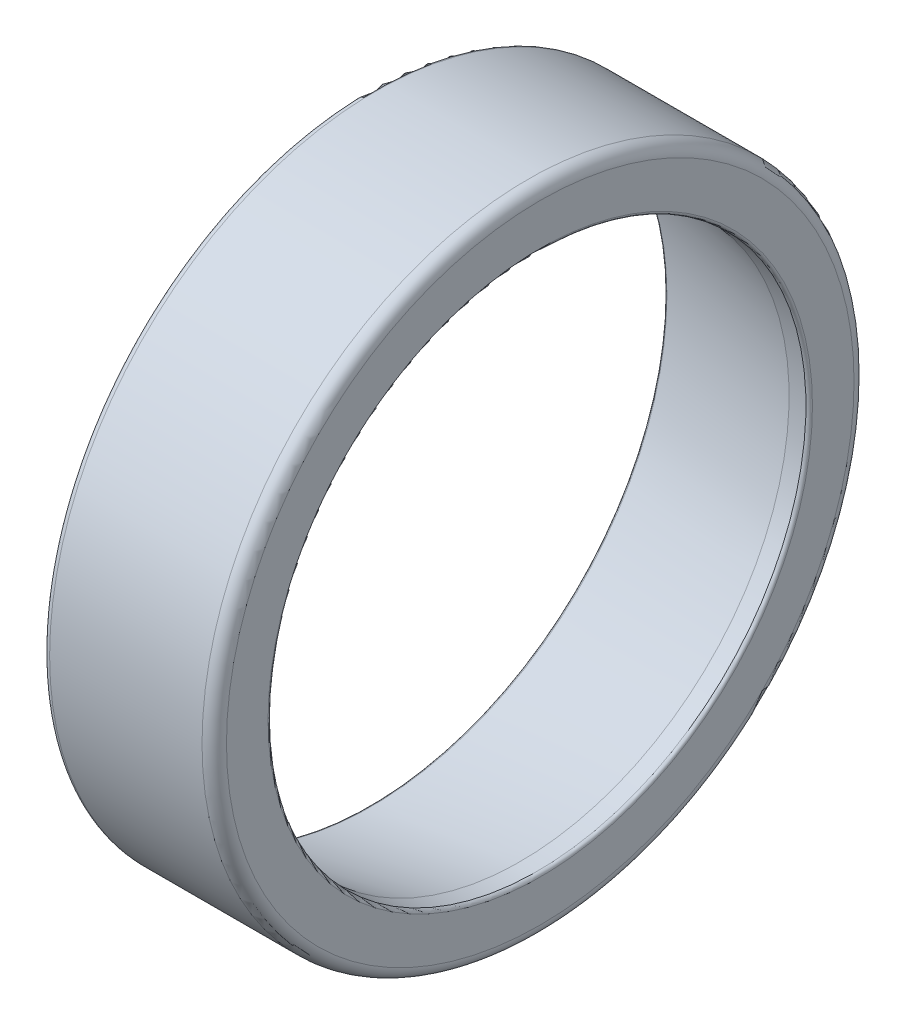
ISO-10303-21;
HEADER;
FILE_DESCRIPTION(('STEP AP214'),'2;1');
FILE_NAME('part.step','',(''),(''),'','','');
FILE_SCHEMA(('AUTOMOTIVE_DESIGN { 1 0 10303 214 1 1 1 1 }'));
ENDSEC;
DATA;
#1=APPLICATION_CONTEXT('core data for automotive mechanical design processes');
#2=APPLICATION_PROTOCOL_DEFINITION('international standard','automotive_design',2000,#1);
#3=PRODUCT_CONTEXT('',#1,'mechanical');
#4=PRODUCT('Part','Part','',(#3));
#5=PRODUCT_RELATED_PRODUCT_CATEGORY('part','',(#4));
#6=PRODUCT_DEFINITION_FORMATION('','',#4);
#7=PRODUCT_DEFINITION_CONTEXT('part definition',#1,'design');
#8=PRODUCT_DEFINITION('design','',#6,#7);
#9=PRODUCT_DEFINITION_SHAPE('','',#8);
#10=(LENGTH_UNIT() NAMED_UNIT(*) SI_UNIT(.MILLI.,.METRE.));
#11=(NAMED_UNIT(*) PLANE_ANGLE_UNIT() SI_UNIT($,.RADIAN.));
#12=(NAMED_UNIT(*) SI_UNIT($,.STERADIAN.) SOLID_ANGLE_UNIT());
#13=UNCERTAINTY_MEASURE_WITH_UNIT(LENGTH_MEASURE(1.E-05),#10,'distance_accuracy_value','');
#14=(GEOMETRIC_REPRESENTATION_CONTEXT(3) GLOBAL_UNCERTAINTY_ASSIGNED_CONTEXT((#13)) GLOBAL_UNIT_ASSIGNED_CONTEXT((#10,
#11,#12)) REPRESENTATION_CONTEXT('',''));
#15=CARTESIAN_POINT('',(0.,0.,0.));
#16=DIRECTION('',(0.,0.,1.));
#17=DIRECTION('',(1.,0.,0.));
#18=AXIS2_PLACEMENT_3D('',#15,#16,#17);
#19=CARTESIAN_POINT('',(1.,36.2676725808077,0.));
#20=DIRECTION('',(1.,0.,0.));
#21=DIRECTION('',(0.,0.,-1.));
#22=AXIS2_PLACEMENT_3D('',#19,#20,#21);
#23=PLANE('',#22);
#24=CARTESIAN_POINT('',(1.,0.,0.));
#25=DIRECTION('',(1.,0.,0.));
#26=DIRECTION('',(0.,0.,-1.));
#27=AXIS2_PLACEMENT_3D('',#24,#25,#26);
#28=CIRCLE('',#27,36.6033124332785);
#29=CARTESIAN_POINT('',(1.,0.,-36.6033124332785));
#30=VERTEX_POINT('',#29);
#31=EDGE_CURVE('E44',#30,#30,#28,.T.);
#32=ORIENTED_EDGE('',*,*,#31,.T.);
#33=EDGE_LOOP('',(#32));
#34=FACE_BOUND('',#33,.T.);
#35=CARTESIAN_POINT('',(1.,0.,0.));
#36=DIRECTION('',(1.,0.,0.));
#37=DIRECTION('',(0.,0.,-1.));
#38=AXIS2_PLACEMENT_3D('',#35,#36,#37);
#39=CIRCLE('',#38,39.2);
#40=CARTESIAN_POINT('',(1.,0.,-39.2));
#41=VERTEX_POINT('',#40);
#42=EDGE_CURVE('E56',#41,#41,#39,.F.);
#43=ORIENTED_EDGE('',*,*,#42,.T.);
#44=EDGE_LOOP('',(#43));
#45=FACE_BOUND('',#44,.T.);
#46=ADVANCED_FACE('F33',(#34,#45),#23,.F.);
#47=CARTESIAN_POINT('',(1.,0.,0.));
#48=DIRECTION('',(-1.,0.,0.));
#49=DIRECTION('',(0.,0.,1.));
#50=AXIS2_PLACEMENT_3D('',#47,#48,#49);
#51=CONICAL_SURFACE('',#50,36.2676725808077,0.174532925199533);
#52=CARTESIAN_POINT('',(1.33054072893321,0.,0.));
#53=DIRECTION('',(1.,0.,0.));
#54=DIRECTION('',(0.,0.,-1.));
#55=AXIS2_PLACEMENT_3D('',#52,#53,#54);
#56=CIRCLE('',#55,36.2093893320736);
#57=CARTESIAN_POINT('',(1.33054072893321,0.,-36.2093893320736));
#58=VERTEX_POINT('',#57);
#59=EDGE_CURVE('E48',#58,#58,#56,.F.);
#60=ORIENTED_EDGE('',*,*,#59,.T.);
#61=EDGE_LOOP('',(#60));
#62=FACE_BOUND('',#61,.T.);
#63=CARTESIAN_POINT('',(19.5318920999869,0.,0.));
#64=DIRECTION('',(-1.,0.,0.));
#65=DIRECTION('',(0.,0.,1.));
#66=AXIS2_PLACEMENT_3D('',#63,#64,#65);
#67=CIRCLE('',#66,33.);
#68=CARTESIAN_POINT('',(19.5318920999869,0.,33.));
#69=VERTEX_POINT('',#68);
#70=EDGE_CURVE('E65',#69,#69,#67,.T.);
#71=ORIENTED_EDGE('',*,*,#70,.F.);
#72=EDGE_LOOP('',(#71));
#73=FACE_BOUND('',#72,.T.);
#74=ADVANCED_FACE('F71',(#62,#73),#51,.F.);
#75=CARTESIAN_POINT('',(0.,0.,0.));
#76=DIRECTION('',(-1.,0.,0.));
#77=DIRECTION('',(0.,0.,1.));
#78=AXIS2_PLACEMENT_3D('',#75,#76,#77);
#79=CYLINDRICAL_SURFACE('',#78,33.);
#80=CARTESIAN_POINT('',(21.6,0.,0.));
#81=DIRECTION('',(-1.,0.,0.));
#82=DIRECTION('',(0.,0.,1.));
#83=AXIS2_PLACEMENT_3D('',#80,#81,#82);
#84=CIRCLE('',#83,33.);
#85=CARTESIAN_POINT('',(21.6,0.,33.));
#86=VERTEX_POINT('',#85);
#87=EDGE_CURVE('E10',#86,#86,#84,.F.);
#88=ORIENTED_EDGE('',*,*,#87,.T.);
#89=EDGE_LOOP('',(#88));
#90=FACE_BOUND('',#89,.T.);
#91=ORIENTED_EDGE('',*,*,#70,.T.);
#92=EDGE_LOOP('',(#91));
#93=FACE_BOUND('',#92,.T.);
#94=ADVANCED_FACE('F69',(#90,#93),#79,.F.);
#95=CARTESIAN_POINT('',(22.,33.,0.));
#96=DIRECTION('',(-1.,0.,0.));
#97=DIRECTION('',(0.,0.,1.));
#98=AXIS2_PLACEMENT_3D('',#95,#96,#97);
#99=PLANE('',#98);
#100=CARTESIAN_POINT('',(22.,0.,0.));
#101=DIRECTION('',(-1.,0.,0.));
#102=DIRECTION('',(0.,0.,1.));
#103=AXIS2_PLACEMENT_3D('',#100,#101,#102);
#104=CIRCLE('',#103,33.4);
#105=CARTESIAN_POINT('',(22.,0.,33.4));
#106=VERTEX_POINT('',#105);
#107=EDGE_CURVE('E40',#106,#106,#104,.T.);
#108=ORIENTED_EDGE('',*,*,#107,.T.);
#109=EDGE_LOOP('',(#108));
#110=FACE_BOUND('',#109,.T.);
#111=CARTESIAN_POINT('',(22.,0.,0.));
#112=DIRECTION('',(-1.,0.,0.));
#113=DIRECTION('',(0.,0.,1.));
#114=AXIS2_PLACEMENT_3D('',#111,#112,#113);
#115=CIRCLE('',#114,38.5);
#116=CARTESIAN_POINT('',(22.,0.,38.5));
#117=VERTEX_POINT('',#116);
#118=EDGE_CURVE('E59',#117,#117,#115,.F.);
#119=ORIENTED_EDGE('',*,*,#118,.T.);
#120=EDGE_LOOP('',(#119));
#121=FACE_BOUND('',#120,.T.);
#122=ADVANCED_FACE('F79',(#110,#121),#99,.F.);
#123=CARTESIAN_POINT('',(0.,0.,0.));
#124=DIRECTION('',(-1.,0.,0.));
#125=DIRECTION('',(0.,0.,1.));
#126=AXIS2_PLACEMENT_3D('',#123,#124,#125);
#127=CYLINDRICAL_SURFACE('',#126,40.);
#128=CARTESIAN_POINT('',(1.8,0.,0.));
#129=DIRECTION('',(1.,0.,0.));
#130=DIRECTION('',(0.,0.,-1.));
#131=AXIS2_PLACEMENT_3D('',#128,#129,#130);
#132=CIRCLE('',#131,40.);
#133=CARTESIAN_POINT('',(1.8,0.,-40.));
#134=VERTEX_POINT('',#133);
#135=EDGE_CURVE('E53',#134,#134,#132,.T.);
#136=ORIENTED_EDGE('',*,*,#135,.T.);
#137=EDGE_LOOP('',(#136));
#138=FACE_BOUND('',#137,.T.);
#139=CARTESIAN_POINT('',(20.5,0.,0.));
#140=DIRECTION('',(-1.,0.,0.));
#141=DIRECTION('',(0.,0.,1.));
#142=AXIS2_PLACEMENT_3D('',#139,#140,#141);
#143=CIRCLE('',#142,40.);
#144=CARTESIAN_POINT('',(20.5,0.,40.));
#145=VERTEX_POINT('',#144);
#146=EDGE_CURVE('E62',#145,#145,#143,.T.);
#147=ORIENTED_EDGE('',*,*,#146,.T.);
#148=EDGE_LOOP('',(#147));
#149=FACE_BOUND('',#148,.T.);
#150=ADVANCED_FACE('F89',(#138,#149),#127,.T.);
#151=CARTESIAN_POINT('',(20.5,0.,0.));
#152=DIRECTION('',(-1.,0.,0.));
#153=DIRECTION('',(0.,0.,1.));
#154=AXIS2_PLACEMENT_3D('',#151,#152,#153);
#155=TOROIDAL_SURFACE('',#154,38.5,1.5);
#156=ORIENTED_EDGE('',*,*,#118,.F.);
#157=EDGE_LOOP('',(#156));
#158=FACE_BOUND('',#157,.T.);
#159=ORIENTED_EDGE('',*,*,#146,.F.);
#160=EDGE_LOOP('',(#159));
#161=FACE_BOUND('',#160,.T.);
#162=ADVANCED_FACE('F85',(#158,#161),#155,.T.);
#163=CARTESIAN_POINT('',(1.8,0.,0.));
#164=DIRECTION('',(1.,0.,0.));
#165=DIRECTION('',(0.,0.,-1.));
#166=AXIS2_PLACEMENT_3D('',#163,#164,#165);
#167=TOROIDAL_SURFACE('',#166,39.2,0.8);
#168=ORIENTED_EDGE('',*,*,#135,.F.);
#169=EDGE_LOOP('',(#168));
#170=FACE_BOUND('',#169,.T.);
#171=ORIENTED_EDGE('',*,*,#42,.F.);
#172=EDGE_LOOP('',(#171));
#173=FACE_BOUND('',#172,.T.);
#174=ADVANCED_FACE('F88',(#170,#173),#167,.T.);
#175=CARTESIAN_POINT('',(1.4,0.,0.));
#176=DIRECTION('',(1.,0.,0.));
#177=DIRECTION('',(0.,0.,-1.));
#178=AXIS2_PLACEMENT_3D('',#175,#176,#177);
#179=TOROIDAL_SURFACE('',#178,36.6033124332785,0.4);
#180=ORIENTED_EDGE('',*,*,#31,.F.);
#181=EDGE_LOOP('',(#180));
#182=FACE_BOUND('',#181,.T.);
#183=ORIENTED_EDGE('',*,*,#59,.F.);
#184=EDGE_LOOP('',(#183));
#185=FACE_BOUND('',#184,.T.);
#186=ADVANCED_FACE('F92',(#182,#185),#179,.T.);
#187=CARTESIAN_POINT('',(21.6,0.,0.));
#188=DIRECTION('',(-1.,0.,0.));
#189=DIRECTION('',(0.,0.,1.));
#190=AXIS2_PLACEMENT_3D('',#187,#188,#189);
#191=TOROIDAL_SURFACE('',#190,33.4,0.4);
#192=ORIENTED_EDGE('',*,*,#87,.F.);
#193=EDGE_LOOP('',(#192));
#194=FACE_BOUND('',#193,.T.);
#195=ORIENTED_EDGE('',*,*,#107,.F.);
#196=EDGE_LOOP('',(#195));
#197=FACE_BOUND('',#196,.T.);
#198=ADVANCED_FACE('F35',(#194,#197),#191,.T.);
#199=CLOSED_SHELL('',(#46,#74,#94,#122,#150,#162,#174,#186,#198));
#200=MANIFOLD_SOLID_BREP('B2',#199);
#201=ADVANCED_BREP_SHAPE_REPRESENTATION('',(#18,#200),#14);
#202=SHAPE_DEFINITION_REPRESENTATION(#9,#201);
ENDSEC;
END-ISO-10303-21;
